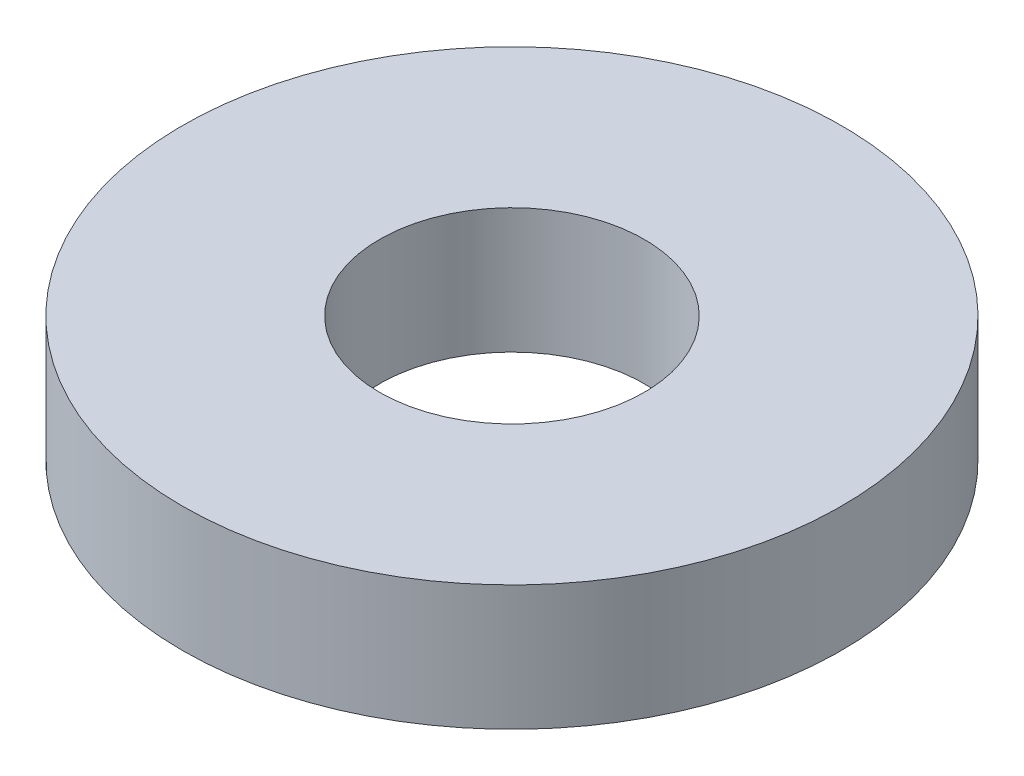
ISO-10303-21;
HEADER;
FILE_DESCRIPTION(('STEP AP214'),'2;1');
FILE_NAME('part.step','',(''),(''),'','','');
FILE_SCHEMA(('AUTOMOTIVE_DESIGN { 1 0 10303 214 1 1 1 1 }'));
ENDSEC;
DATA;
#1=APPLICATION_CONTEXT('core data for automotive mechanical design processes');
#2=APPLICATION_PROTOCOL_DEFINITION('international standard','automotive_design',2000,#1);
#3=PRODUCT_CONTEXT('',#1,'mechanical');
#4=PRODUCT('Part','Part','',(#3));
#5=PRODUCT_RELATED_PRODUCT_CATEGORY('part','',(#4));
#6=PRODUCT_DEFINITION_FORMATION('','',#4);
#7=PRODUCT_DEFINITION_CONTEXT('part definition',#1,'design');
#8=PRODUCT_DEFINITION('design','',#6,#7);
#9=PRODUCT_DEFINITION_SHAPE('','',#8);
#10=(LENGTH_UNIT() NAMED_UNIT(*) SI_UNIT(.MILLI.,.METRE.));
#11=(NAMED_UNIT(*) PLANE_ANGLE_UNIT() SI_UNIT($,.RADIAN.));
#12=(NAMED_UNIT(*) SI_UNIT($,.STERADIAN.) SOLID_ANGLE_UNIT());
#13=UNCERTAINTY_MEASURE_WITH_UNIT(LENGTH_MEASURE(1.E-05),#10,'distance_accuracy_value','');
#14=(GEOMETRIC_REPRESENTATION_CONTEXT(3) GLOBAL_UNCERTAINTY_ASSIGNED_CONTEXT((#13)) GLOBAL_UNIT_ASSIGNED_CONTEXT((#10,
#11,#12)) REPRESENTATION_CONTEXT('',''));
#15=CARTESIAN_POINT('',(0.,0.,0.));
#16=DIRECTION('',(0.,0.,1.));
#17=DIRECTION('',(1.,0.,0.));
#18=AXIS2_PLACEMENT_3D('',#15,#16,#17);
#19=CARTESIAN_POINT('',(-5.91227949599085,2.9972,-13.8632760595647));
#20=DIRECTION('',(0.,1.,0.));
#21=DIRECTION('',(0.,0.,1.));
#22=AXIS2_PLACEMENT_3D('',#19,#20,#21);
#23=PLANE('',#22);
#24=CARTESIAN_POINT('',(-5.91227949599085,2.9972,-13.8632760595647));
#25=DIRECTION('',(0.,1.,0.));
#26=DIRECTION('',(0.,0.,1.));
#27=AXIS2_PLACEMENT_3D('',#24,#25,#26);
#28=CIRCLE('',#27,7.8994);
#29=CARTESIAN_POINT('',(-5.91227949599085,2.9972,-5.96387605956472));
#30=VERTEX_POINT('',#29);
#31=EDGE_CURVE('E10',#30,#30,#28,.T.);
#32=ORIENTED_EDGE('',*,*,#31,.T.);
#33=EDGE_LOOP('',(#32));
#34=FACE_BOUND('',#33,.T.);
#35=CARTESIAN_POINT('',(-5.91227949599085,2.9972,-13.8632760595647));
#36=DIRECTION('',(0.,1.,0.));
#37=DIRECTION('',(0.,0.,1.));
#38=AXIS2_PLACEMENT_3D('',#35,#36,#37);
#39=CIRCLE('',#38,3.175);
#40=CARTESIAN_POINT('',(-5.91227949599085,2.9972,-10.6882760595647));
#41=VERTEX_POINT('',#40);
#42=EDGE_CURVE('E41',#41,#41,#39,.T.);
#43=ORIENTED_EDGE('',*,*,#42,.F.);
#44=EDGE_LOOP('',(#43));
#45=FACE_BOUND('',#44,.T.);
#46=ADVANCED_FACE('F30',(#34,#45),#23,.T.);
#47=CARTESIAN_POINT('',(-5.91227949599085,0.,-13.8632760595647));
#48=DIRECTION('',(0.,1.,0.));
#49=DIRECTION('',(0.,0.,1.));
#50=AXIS2_PLACEMENT_3D('',#47,#48,#49);
#51=PLANE('',#50);
#52=CARTESIAN_POINT('',(-5.91227949599085,0.,-13.8632760595647));
#53=DIRECTION('',(0.,1.,0.));
#54=DIRECTION('',(0.,0.,1.));
#55=AXIS2_PLACEMENT_3D('',#52,#53,#54);
#56=CIRCLE('',#55,7.8994);
#57=CARTESIAN_POINT('',(-5.91227949599085,0.,-5.96387605956472));
#58=VERTEX_POINT('',#57);
#59=EDGE_CURVE('E34',#58,#58,#56,.T.);
#60=ORIENTED_EDGE('',*,*,#59,.F.);
#61=EDGE_LOOP('',(#60));
#62=FACE_BOUND('',#61,.T.);
#63=CARTESIAN_POINT('',(-5.91227949599085,0.,-13.8632760595647));
#64=DIRECTION('',(0.,1.,0.));
#65=DIRECTION('',(0.,0.,1.));
#66=AXIS2_PLACEMENT_3D('',#63,#64,#65);
#67=CIRCLE('',#66,3.175);
#68=CARTESIAN_POINT('',(-5.91227949599085,0.,-10.6882760595647));
#69=VERTEX_POINT('',#68);
#70=EDGE_CURVE('E43',#69,#69,#67,.T.);
#71=ORIENTED_EDGE('',*,*,#70,.T.);
#72=EDGE_LOOP('',(#71));
#73=FACE_BOUND('',#72,.T.);
#74=ADVANCED_FACE('F53',(#62,#73),#51,.F.);
#75=CARTESIAN_POINT('',(-5.91227949599085,2.9972,-13.8632760595647));
#76=DIRECTION('',(0.,-1.,0.));
#77=DIRECTION('',(0.,0.,-1.));
#78=AXIS2_PLACEMENT_3D('',#75,#76,#77);
#79=CYLINDRICAL_SURFACE('',#78,7.8994);
#80=ORIENTED_EDGE('',*,*,#31,.F.);
#81=EDGE_LOOP('',(#80));
#82=FACE_BOUND('',#81,.T.);
#83=ORIENTED_EDGE('',*,*,#59,.T.);
#84=EDGE_LOOP('',(#83));
#85=FACE_BOUND('',#84,.T.);
#86=ADVANCED_FACE('F32',(#82,#85),#79,.T.);
#87=CARTESIAN_POINT('',(-5.91227949599085,2.9972,-13.8632760595647));
#88=DIRECTION('',(0.,-1.,0.));
#89=DIRECTION('',(0.,0.,-1.));
#90=AXIS2_PLACEMENT_3D('',#87,#88,#89);
#91=CYLINDRICAL_SURFACE('',#90,3.175);
#92=ORIENTED_EDGE('',*,*,#42,.T.);
#93=EDGE_LOOP('',(#92));
#94=FACE_BOUND('',#93,.T.);
#95=ORIENTED_EDGE('',*,*,#70,.F.);
#96=EDGE_LOOP('',(#95));
#97=FACE_BOUND('',#96,.T.);
#98=ADVANCED_FACE('F49',(#94,#97),#91,.F.);
#99=CLOSED_SHELL('',(#46,#74,#86,#98));
#100=MANIFOLD_SOLID_BREP('B2',#99);
#101=ADVANCED_BREP_SHAPE_REPRESENTATION('',(#18,#100),#14);
#102=SHAPE_DEFINITION_REPRESENTATION(#9,#101);
ENDSEC;
END-ISO-10303-21;
